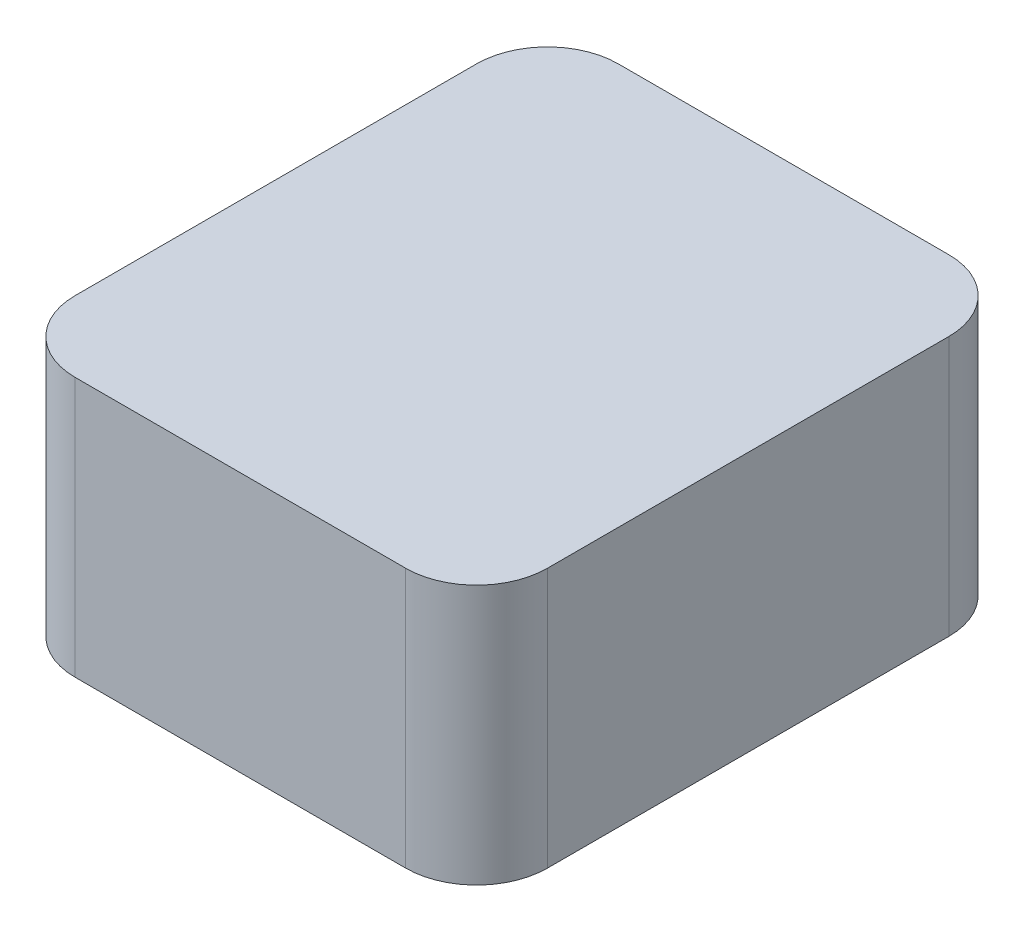
ISO-10303-21;
HEADER;
FILE_DESCRIPTION(('STEP AP214'),'2;1');
FILE_NAME('part.step','',(''),(''),'','','');
FILE_SCHEMA(('AUTOMOTIVE_DESIGN { 1 0 10303 214 1 1 1 1 }'));
ENDSEC;
DATA;
#1=APPLICATION_CONTEXT('core data for automotive mechanical design processes');
#2=APPLICATION_PROTOCOL_DEFINITION('international standard','automotive_design',2000,#1);
#3=PRODUCT_CONTEXT('',#1,'mechanical');
#4=PRODUCT('Part','Part','',(#3));
#5=PRODUCT_RELATED_PRODUCT_CATEGORY('part','',(#4));
#6=PRODUCT_DEFINITION_FORMATION('','',#4);
#7=PRODUCT_DEFINITION_CONTEXT('part definition',#1,'design');
#8=PRODUCT_DEFINITION('design','',#6,#7);
#9=PRODUCT_DEFINITION_SHAPE('','',#8);
#10=(LENGTH_UNIT() NAMED_UNIT(*) SI_UNIT(.MILLI.,.METRE.));
#11=(NAMED_UNIT(*) PLANE_ANGLE_UNIT() SI_UNIT($,.RADIAN.));
#12=(NAMED_UNIT(*) SI_UNIT($,.STERADIAN.) SOLID_ANGLE_UNIT());
#13=UNCERTAINTY_MEASURE_WITH_UNIT(LENGTH_MEASURE(1.E-05),#10,'distance_accuracy_value','');
#14=(GEOMETRIC_REPRESENTATION_CONTEXT(3) GLOBAL_UNCERTAINTY_ASSIGNED_CONTEXT((#13)) GLOBAL_UNIT_ASSIGNED_CONTEXT((#10,
#11,#12)) REPRESENTATION_CONTEXT('',''));
#15=CARTESIAN_POINT('',(0.,0.,0.));
#16=DIRECTION('',(0.,0.,1.));
#17=DIRECTION('',(1.,0.,0.));
#18=AXIS2_PLACEMENT_3D('',#15,#16,#17);
#19=CARTESIAN_POINT('',(0.,11.,0.));
#20=DIRECTION('',(1.,0.,0.));
#21=DIRECTION('',(0.,0.,-1.));
#22=AXIS2_PLACEMENT_3D('',#19,#20,#21);
#23=PLANE('',#22);
#24=DIRECTION('',(0.,0.,1.));
#25=VECTOR('',#24,1.);
#26=CARTESIAN_POINT('',(0.,11.,0.));
#27=LINE('',#26,#25);
#28=CARTESIAN_POINT('',(0.,11.,-20.));
#29=VERTEX_POINT('',#28);
#30=CARTESIAN_POINT('',(0.,11.,-3.));
#31=VERTEX_POINT('',#30);
#32=EDGE_CURVE('E139',#29,#31,#27,.T.);
#33=ORIENTED_EDGE('',*,*,#32,.F.);
#34=DIRECTION('',(0.,-1.,0.));
#35=VECTOR('',#34,1.);
#36=CARTESIAN_POINT('',(0.,11.,-20.));
#37=LINE('',#36,#35);
#38=CARTESIAN_POINT('',(0.,0.,-20.));
#39=VERTEX_POINT('',#38);
#40=EDGE_CURVE('E178',#29,#39,#37,.T.);
#41=ORIENTED_EDGE('',*,*,#40,.T.);
#42=DIRECTION('',(0.,0.,1.));
#43=VECTOR('',#42,1.);
#44=CARTESIAN_POINT('',(0.,0.,0.));
#45=LINE('',#44,#43);
#46=CARTESIAN_POINT('',(0.,0.,-3.));
#47=VERTEX_POINT('',#46);
#48=EDGE_CURVE('E192',#39,#47,#45,.T.);
#49=ORIENTED_EDGE('',*,*,#48,.T.);
#50=DIRECTION('',(0.,-1.,0.));
#51=VECTOR('',#50,1.);
#52=CARTESIAN_POINT('',(0.,11.,-3.));
#53=LINE('',#52,#51);
#54=EDGE_CURVE('E175',#47,#31,#53,.F.);
#55=ORIENTED_EDGE('',*,*,#54,.T.);
#56=EDGE_LOOP('',(#33,#41,#49,#55));
#57=FACE_BOUND('',#56,.T.);
#58=ADVANCED_FACE('F43',(#57),#23,.F.);
#59=CARTESIAN_POINT('',(0.,11.,0.));
#60=DIRECTION('',(0.,0.,-1.));
#61=DIRECTION('',(-1.,0.,0.));
#62=AXIS2_PLACEMENT_3D('',#59,#60,#61);
#63=PLANE('',#62);
#64=DIRECTION('',(1.,0.,0.));
#65=VECTOR('',#64,1.);
#66=CARTESIAN_POINT('',(0.,11.,0.));
#67=LINE('',#66,#65);
#68=CARTESIAN_POINT('',(3.,11.,0.));
#69=VERTEX_POINT('',#68);
#70=CARTESIAN_POINT('',(17.,11.,0.));
#71=VERTEX_POINT('',#70);
#72=EDGE_CURVE('E144',#69,#71,#67,.T.);
#73=ORIENTED_EDGE('',*,*,#72,.F.);
#74=DIRECTION('',(0.,-1.,0.));
#75=VECTOR('',#74,1.);
#76=CARTESIAN_POINT('',(3.,11.,0.));
#77=LINE('',#76,#75);
#78=CARTESIAN_POINT('',(3.,0.,0.));
#79=VERTEX_POINT('',#78);
#80=EDGE_CURVE('E11',#69,#79,#77,.T.);
#81=ORIENTED_EDGE('',*,*,#80,.T.);
#82=DIRECTION('',(1.,0.,0.));
#83=VECTOR('',#82,1.);
#84=CARTESIAN_POINT('',(0.,0.,0.));
#85=LINE('',#84,#83);
#86=CARTESIAN_POINT('',(17.,0.,0.));
#87=VERTEX_POINT('',#86);
#88=EDGE_CURVE('E146',#79,#87,#85,.T.);
#89=ORIENTED_EDGE('',*,*,#88,.T.);
#90=DIRECTION('',(0.,-1.,0.));
#91=VECTOR('',#90,1.);
#92=CARTESIAN_POINT('',(17.,11.,0.));
#93=LINE('',#92,#91);
#94=EDGE_CURVE('E52',#87,#71,#93,.F.);
#95=ORIENTED_EDGE('',*,*,#94,.T.);
#96=EDGE_LOOP('',(#73,#81,#89,#95));
#97=FACE_BOUND('',#96,.T.);
#98=ADVANCED_FACE('F197',(#97),#63,.F.);
#99=CARTESIAN_POINT('',(20.,11.,0.));
#100=DIRECTION('',(-1.,0.,0.));
#101=DIRECTION('',(0.,0.,1.));
#102=AXIS2_PLACEMENT_3D('',#99,#100,#101);
#103=PLANE('',#102);
#104=DIRECTION('',(0.,0.,-1.));
#105=VECTOR('',#104,1.);
#106=CARTESIAN_POINT('',(20.,0.,0.));
#107=LINE('',#106,#105);
#108=CARTESIAN_POINT('',(20.,0.,-3.));
#109=VERTEX_POINT('',#108);
#110=CARTESIAN_POINT('',(20.,0.,-20.));
#111=VERTEX_POINT('',#110);
#112=EDGE_CURVE('E140',#109,#111,#107,.T.);
#113=ORIENTED_EDGE('',*,*,#112,.T.);
#114=DIRECTION('',(0.,-1.,0.));
#115=VECTOR('',#114,1.);
#116=CARTESIAN_POINT('',(20.,11.,-20.));
#117=LINE('',#116,#115);
#118=CARTESIAN_POINT('',(20.,11.,-20.));
#119=VERTEX_POINT('',#118);
#120=EDGE_CURVE('E115',#111,#119,#117,.F.);
#121=ORIENTED_EDGE('',*,*,#120,.T.);
#122=DIRECTION('',(0.,0.,-1.));
#123=VECTOR('',#122,1.);
#124=CARTESIAN_POINT('',(20.,11.,0.));
#125=LINE('',#124,#123);
#126=CARTESIAN_POINT('',(20.,11.,-3.));
#127=VERTEX_POINT('',#126);
#128=EDGE_CURVE('E184',#127,#119,#125,.T.);
#129=ORIENTED_EDGE('',*,*,#128,.F.);
#130=DIRECTION('',(0.,-1.,0.));
#131=VECTOR('',#130,1.);
#132=CARTESIAN_POINT('',(20.,11.,-3.));
#133=LINE('',#132,#131);
#134=EDGE_CURVE('E121',#127,#109,#133,.T.);
#135=ORIENTED_EDGE('',*,*,#134,.T.);
#136=EDGE_LOOP('',(#113,#121,#129,#135));
#137=FACE_BOUND('',#136,.T.);
#138=ADVANCED_FACE('F204',(#137),#103,.F.);
#139=CARTESIAN_POINT('',(0.,11.,-23.));
#140=DIRECTION('',(0.,0.,1.));
#141=DIRECTION('',(1.,0.,0.));
#142=AXIS2_PLACEMENT_3D('',#139,#140,#141);
#143=PLANE('',#142);
#144=DIRECTION('',(-1.,0.,0.));
#145=VECTOR('',#144,1.);
#146=CARTESIAN_POINT('',(0.,11.,-23.));
#147=LINE('',#146,#145);
#148=CARTESIAN_POINT('',(17.,11.,-23.));
#149=VERTEX_POINT('',#148);
#150=CARTESIAN_POINT('',(3.,11.,-23.));
#151=VERTEX_POINT('',#150);
#152=EDGE_CURVE('E131',#149,#151,#147,.T.);
#153=ORIENTED_EDGE('',*,*,#152,.F.);
#154=DIRECTION('',(0.,-1.,0.));
#155=VECTOR('',#154,1.);
#156=CARTESIAN_POINT('',(17.,11.,-23.));
#157=LINE('',#156,#155);
#158=CARTESIAN_POINT('',(17.,0.,-23.));
#159=VERTEX_POINT('',#158);
#160=EDGE_CURVE('E114',#149,#159,#157,.T.);
#161=ORIENTED_EDGE('',*,*,#160,.T.);
#162=DIRECTION('',(-1.,0.,0.));
#163=VECTOR('',#162,1.);
#164=CARTESIAN_POINT('',(0.,0.,-23.));
#165=LINE('',#164,#163);
#166=CARTESIAN_POINT('',(3.,0.,-23.));
#167=VERTEX_POINT('',#166);
#168=EDGE_CURVE('E128',#159,#167,#165,.T.);
#169=ORIENTED_EDGE('',*,*,#168,.T.);
#170=DIRECTION('',(0.,-1.,0.));
#171=VECTOR('',#170,1.);
#172=CARTESIAN_POINT('',(3.,11.,-23.));
#173=LINE('',#172,#171);
#174=EDGE_CURVE('E134',#167,#151,#173,.F.);
#175=ORIENTED_EDGE('',*,*,#174,.T.);
#176=EDGE_LOOP('',(#153,#161,#169,#175));
#177=FACE_BOUND('',#176,.T.);
#178=ADVANCED_FACE('F127',(#177),#143,.F.);
#179=CARTESIAN_POINT('',(0.,11.,0.));
#180=DIRECTION('',(0.,-1.,0.));
#181=DIRECTION('',(0.,0.,-1.));
#182=AXIS2_PLACEMENT_3D('',#179,#180,#181);
#183=PLANE('',#182);
#184=ORIENTED_EDGE('',*,*,#128,.T.);
#185=CARTESIAN_POINT('',(17.,11.,-20.));
#186=DIRECTION('',(0.,-1.,0.));
#187=DIRECTION('',(0.,0.,-1.));
#188=AXIS2_PLACEMENT_3D('',#185,#186,#187);
#189=CIRCLE('',#188,3.);
#190=EDGE_CURVE('E172',#119,#149,#189,.F.);
#191=ORIENTED_EDGE('',*,*,#190,.T.);
#192=ORIENTED_EDGE('',*,*,#152,.T.);
#193=CARTESIAN_POINT('',(3.,11.,-20.));
#194=DIRECTION('',(0.,-1.,0.));
#195=DIRECTION('',(0.,0.,-1.));
#196=AXIS2_PLACEMENT_3D('',#193,#194,#195);
#197=CIRCLE('',#196,3.);
#198=EDGE_CURVE('E169',#151,#29,#197,.F.);
#199=ORIENTED_EDGE('',*,*,#198,.T.);
#200=ORIENTED_EDGE('',*,*,#32,.T.);
#201=CARTESIAN_POINT('',(3.,11.,-3.));
#202=DIRECTION('',(0.,-1.,0.));
#203=DIRECTION('',(0.,0.,-1.));
#204=AXIS2_PLACEMENT_3D('',#201,#202,#203);
#205=CIRCLE('',#204,3.);
#206=EDGE_CURVE('E65',#31,#69,#205,.F.);
#207=ORIENTED_EDGE('',*,*,#206,.T.);
#208=ORIENTED_EDGE('',*,*,#72,.T.);
#209=CARTESIAN_POINT('',(17.,11.,-3.));
#210=DIRECTION('',(0.,-1.,0.));
#211=DIRECTION('',(0.,0.,-1.));
#212=AXIS2_PLACEMENT_3D('',#209,#210,#211);
#213=CIRCLE('',#212,3.);
#214=EDGE_CURVE('E164',#71,#127,#213,.F.);
#215=ORIENTED_EDGE('',*,*,#214,.T.);
#216=EDGE_LOOP('',(#184,#191,#192,#199,#200,#207,#208,#215));
#217=FACE_BOUND('',#216,.T.);
#218=ADVANCED_FACE('F202',(#217),#183,.F.);
#219=CARTESIAN_POINT('',(0.,0.,0.));
#220=DIRECTION('',(0.,-1.,0.));
#221=DIRECTION('',(0.,0.,-1.));
#222=AXIS2_PLACEMENT_3D('',#219,#220,#221);
#223=PLANE('',#222);
#224=ORIENTED_EDGE('',*,*,#168,.F.);
#225=CARTESIAN_POINT('',(17.,0.,-20.));
#226=DIRECTION('',(0.,-1.,0.));
#227=DIRECTION('',(0.,0.,-1.));
#228=AXIS2_PLACEMENT_3D('',#225,#226,#227);
#229=CIRCLE('',#228,3.);
#230=EDGE_CURVE('E110',#159,#111,#229,.T.);
#231=ORIENTED_EDGE('',*,*,#230,.T.);
#232=ORIENTED_EDGE('',*,*,#112,.F.);
#233=CARTESIAN_POINT('',(17.,0.,-3.));
#234=DIRECTION('',(0.,-1.,0.));
#235=DIRECTION('',(0.,0.,-1.));
#236=AXIS2_PLACEMENT_3D('',#233,#234,#235);
#237=CIRCLE('',#236,3.);
#238=EDGE_CURVE('E133',#109,#87,#237,.T.);
#239=ORIENTED_EDGE('',*,*,#238,.T.);
#240=ORIENTED_EDGE('',*,*,#88,.F.);
#241=CARTESIAN_POINT('',(3.,0.,-3.));
#242=DIRECTION('',(0.,-1.,0.));
#243=DIRECTION('',(0.,0.,-1.));
#244=AXIS2_PLACEMENT_3D('',#241,#242,#243);
#245=CIRCLE('',#244,3.);
#246=EDGE_CURVE('E154',#79,#47,#245,.T.);
#247=ORIENTED_EDGE('',*,*,#246,.T.);
#248=ORIENTED_EDGE('',*,*,#48,.F.);
#249=CARTESIAN_POINT('',(3.,0.,-20.));
#250=DIRECTION('',(0.,-1.,0.));
#251=DIRECTION('',(0.,0.,-1.));
#252=AXIS2_PLACEMENT_3D('',#249,#250,#251);
#253=CIRCLE('',#252,3.);
#254=EDGE_CURVE('E122',#39,#167,#253,.T.);
#255=ORIENTED_EDGE('',*,*,#254,.T.);
#256=EDGE_LOOP('',(#224,#231,#232,#239,#240,#247,#248,#255));
#257=FACE_BOUND('',#256,.T.);
#258=ADVANCED_FACE('F136',(#257),#223,.T.);
#259=CARTESIAN_POINT('',(17.,11.,-20.));
#260=DIRECTION('',(0.,-1.,0.));
#261=DIRECTION('',(0.,0.,-1.));
#262=AXIS2_PLACEMENT_3D('',#259,#260,#261);
#263=CYLINDRICAL_SURFACE('',#262,3.);
#264=ORIENTED_EDGE('',*,*,#190,.F.);
#265=ORIENTED_EDGE('',*,*,#120,.F.);
#266=ORIENTED_EDGE('',*,*,#230,.F.);
#267=ORIENTED_EDGE('',*,*,#160,.F.);
#268=EDGE_LOOP('',(#264,#265,#266,#267));
#269=FACE_BOUND('',#268,.T.);
#270=ADVANCED_FACE('F113',(#269),#263,.T.);
#271=CARTESIAN_POINT('',(3.,11.,-20.));
#272=DIRECTION('',(0.,-1.,0.));
#273=DIRECTION('',(0.,0.,-1.));
#274=AXIS2_PLACEMENT_3D('',#271,#272,#273);
#275=CYLINDRICAL_SURFACE('',#274,3.);
#276=ORIENTED_EDGE('',*,*,#198,.F.);
#277=ORIENTED_EDGE('',*,*,#174,.F.);
#278=ORIENTED_EDGE('',*,*,#254,.F.);
#279=ORIENTED_EDGE('',*,*,#40,.F.);
#280=EDGE_LOOP('',(#276,#277,#278,#279));
#281=FACE_BOUND('',#280,.T.);
#282=ADVANCED_FACE('F222',(#281),#275,.T.);
#283=CARTESIAN_POINT('',(3.,11.,-3.));
#284=DIRECTION('',(0.,-1.,0.));
#285=DIRECTION('',(0.,0.,-1.));
#286=AXIS2_PLACEMENT_3D('',#283,#284,#285);
#287=CYLINDRICAL_SURFACE('',#286,3.);
#288=ORIENTED_EDGE('',*,*,#206,.F.);
#289=ORIENTED_EDGE('',*,*,#54,.F.);
#290=ORIENTED_EDGE('',*,*,#246,.F.);
#291=ORIENTED_EDGE('',*,*,#80,.F.);
#292=EDGE_LOOP('',(#288,#289,#290,#291));
#293=FACE_BOUND('',#292,.T.);
#294=ADVANCED_FACE('F224',(#293),#287,.T.);
#295=CARTESIAN_POINT('',(17.,11.,-3.));
#296=DIRECTION('',(0.,-1.,0.));
#297=DIRECTION('',(0.,0.,-1.));
#298=AXIS2_PLACEMENT_3D('',#295,#296,#297);
#299=CYLINDRICAL_SURFACE('',#298,3.);
#300=ORIENTED_EDGE('',*,*,#214,.F.);
#301=ORIENTED_EDGE('',*,*,#94,.F.);
#302=ORIENTED_EDGE('',*,*,#238,.F.);
#303=ORIENTED_EDGE('',*,*,#134,.F.);
#304=EDGE_LOOP('',(#300,#301,#302,#303));
#305=FACE_BOUND('',#304,.T.);
#306=ADVANCED_FACE('F45',(#305),#299,.T.);
#307=CLOSED_SHELL('',(#58,#98,#138,#178,#218,#258,#270,#282,#294,#306));
#308=MANIFOLD_SOLID_BREP('B2',#307);
#309=ADVANCED_BREP_SHAPE_REPRESENTATION('',(#18,#308),#14);
#310=SHAPE_DEFINITION_REPRESENTATION(#9,#309);
ENDSEC;
END-ISO-10303-21;
